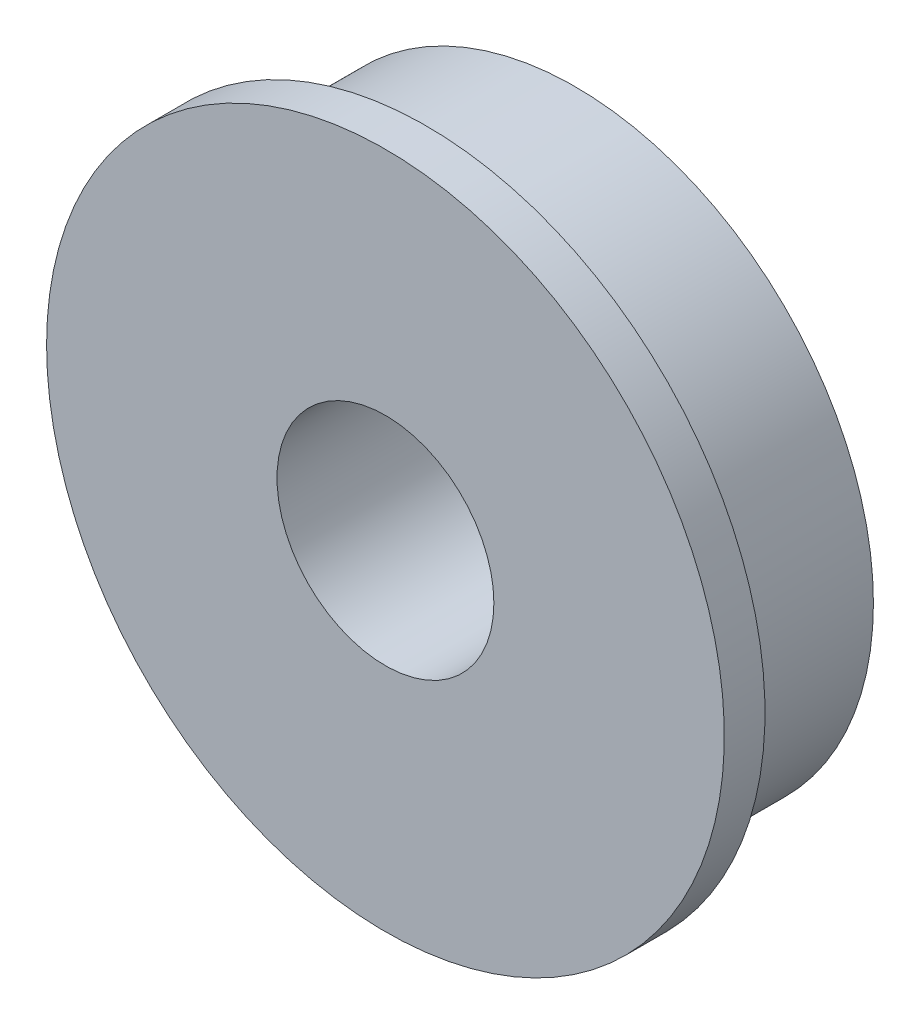
ISO-10303-21;
HEADER;
FILE_DESCRIPTION(('STEP AP214'),'2;1');
FILE_NAME('part.step','',(''),(''),'','','');
FILE_SCHEMA(('AUTOMOTIVE_DESIGN { 1 0 10303 214 1 1 1 1 }'));
ENDSEC;
DATA;
#1=APPLICATION_CONTEXT('core data for automotive mechanical design processes');
#2=APPLICATION_PROTOCOL_DEFINITION('international standard','automotive_design',2000,#1);
#3=PRODUCT_CONTEXT('',#1,'mechanical');
#4=PRODUCT('Part','Part','',(#3));
#5=PRODUCT_RELATED_PRODUCT_CATEGORY('part','',(#4));
#6=PRODUCT_DEFINITION_FORMATION('','',#4);
#7=PRODUCT_DEFINITION_CONTEXT('part definition',#1,'design');
#8=PRODUCT_DEFINITION('design','',#6,#7);
#9=PRODUCT_DEFINITION_SHAPE('','',#8);
#10=(LENGTH_UNIT() NAMED_UNIT(*) SI_UNIT(.MILLI.,.METRE.));
#11=(NAMED_UNIT(*) PLANE_ANGLE_UNIT() SI_UNIT($,.RADIAN.));
#12=(NAMED_UNIT(*) SI_UNIT($,.STERADIAN.) SOLID_ANGLE_UNIT());
#13=UNCERTAINTY_MEASURE_WITH_UNIT(LENGTH_MEASURE(1.E-05),#10,'distance_accuracy_value','');
#14=(GEOMETRIC_REPRESENTATION_CONTEXT(3) GLOBAL_UNCERTAINTY_ASSIGNED_CONTEXT((#13)) GLOBAL_UNIT_ASSIGNED_CONTEXT((#10,
#11,#12)) REPRESENTATION_CONTEXT('',''));
#15=CARTESIAN_POINT('',(0.,0.,0.));
#16=DIRECTION('',(0.,0.,1.));
#17=DIRECTION('',(1.,0.,0.));
#18=AXIS2_PLACEMENT_3D('',#15,#16,#17);
#19=CARTESIAN_POINT('',(0.,0.,0.));
#20=DIRECTION('',(0.,0.,1.));
#21=DIRECTION('',(1.,0.,0.));
#22=AXIS2_PLACEMENT_3D('',#19,#20,#21);
#23=CYLINDRICAL_SURFACE('',#22,11.);
#24=CARTESIAN_POINT('',(0.,0.,0.));
#25=DIRECTION('',(0.,0.,1.));
#26=DIRECTION('',(1.,0.,0.));
#27=AXIS2_PLACEMENT_3D('',#24,#25,#26);
#28=CIRCLE('',#27,11.);
#29=CARTESIAN_POINT('',(11.,0.,0.));
#30=VERTEX_POINT('',#29);
#31=EDGE_CURVE('E33',#30,#30,#28,.T.);
#32=ORIENTED_EDGE('',*,*,#31,.T.);
#33=EDGE_LOOP('',(#32));
#34=FACE_BOUND('',#33,.T.);
#35=CARTESIAN_POINT('',(0.,0.,5.5));
#36=DIRECTION('',(0.,0.,1.));
#37=DIRECTION('',(1.,0.,0.));
#38=AXIS2_PLACEMENT_3D('',#35,#36,#37);
#39=CIRCLE('',#38,11.);
#40=CARTESIAN_POINT('',(11.,0.,5.5));
#41=VERTEX_POINT('',#40);
#42=EDGE_CURVE('E17',#41,#41,#39,.F.);
#43=ORIENTED_EDGE('',*,*,#42,.T.);
#44=EDGE_LOOP('',(#43));
#45=FACE_BOUND('',#44,.T.);
#46=ADVANCED_FACE('F14',(#34,#45),#23,.T.);
#47=CARTESIAN_POINT('',(0.,0.,5.5));
#48=DIRECTION('',(0.,0.,1.));
#49=DIRECTION('',(1.,0.,0.));
#50=AXIS2_PLACEMENT_3D('',#47,#48,#49);
#51=PLANE('',#50);
#52=CARTESIAN_POINT('',(0.,0.,5.5));
#53=DIRECTION('',(0.,0.,-1.));
#54=DIRECTION('',(-1.,0.,0.));
#55=AXIS2_PLACEMENT_3D('',#52,#53,#54);
#56=CIRCLE('',#55,12.5);
#57=CARTESIAN_POINT('',(-12.5,0.,5.5));
#58=VERTEX_POINT('',#57);
#59=EDGE_CURVE('E31',#58,#58,#56,.F.);
#60=ORIENTED_EDGE('',*,*,#59,.F.);
#61=EDGE_LOOP('',(#60));
#62=FACE_BOUND('',#61,.T.);
#63=ORIENTED_EDGE('',*,*,#42,.F.);
#64=EDGE_LOOP('',(#63));
#65=FACE_BOUND('',#64,.T.);
#66=ADVANCED_FACE('F41',(#62,#65),#51,.F.);
#67=CARTESIAN_POINT('',(0.,0.,0.));
#68=DIRECTION('',(0.,0.,1.));
#69=DIRECTION('',(1.,0.,0.));
#70=AXIS2_PLACEMENT_3D('',#67,#68,#69);
#71=PLANE('',#70);
#72=ORIENTED_EDGE('',*,*,#31,.F.);
#73=EDGE_LOOP('',(#72));
#74=FACE_BOUND('',#73,.T.);
#75=CARTESIAN_POINT('',(0.,0.,0.));
#76=DIRECTION('',(0.,0.,1.));
#77=DIRECTION('',(1.,0.,0.));
#78=AXIS2_PLACEMENT_3D('',#75,#76,#77);
#79=CIRCLE('',#78,4.);
#80=CARTESIAN_POINT('',(4.,0.,0.));
#81=VERTEX_POINT('',#80);
#82=EDGE_CURVE('E26',#81,#81,#79,.T.);
#83=ORIENTED_EDGE('',*,*,#82,.T.);
#84=EDGE_LOOP('',(#83));
#85=FACE_BOUND('',#84,.T.);
#86=ADVANCED_FACE('F43',(#74,#85),#71,.F.);
#87=CARTESIAN_POINT('',(0.,0.,7.));
#88=DIRECTION('',(0.,0.,-1.));
#89=DIRECTION('',(-1.,0.,0.));
#90=AXIS2_PLACEMENT_3D('',#87,#88,#89);
#91=CYLINDRICAL_SURFACE('',#90,12.5);
#92=CARTESIAN_POINT('',(0.,0.,7.));
#93=DIRECTION('',(0.,0.,-1.));
#94=DIRECTION('',(-1.,0.,0.));
#95=AXIS2_PLACEMENT_3D('',#92,#93,#94);
#96=CIRCLE('',#95,12.5);
#97=CARTESIAN_POINT('',(-12.5,0.,7.));
#98=VERTEX_POINT('',#97);
#99=EDGE_CURVE('E21',#98,#98,#96,.F.);
#100=ORIENTED_EDGE('',*,*,#99,.F.);
#101=EDGE_LOOP('',(#100));
#102=FACE_BOUND('',#101,.T.);
#103=ORIENTED_EDGE('',*,*,#59,.T.);
#104=EDGE_LOOP('',(#103));
#105=FACE_BOUND('',#104,.T.);
#106=ADVANCED_FACE('F50',(#102,#105),#91,.T.);
#107=CARTESIAN_POINT('',(0.,0.,0.));
#108=DIRECTION('',(0.,0.,1.));
#109=DIRECTION('',(1.,0.,0.));
#110=AXIS2_PLACEMENT_3D('',#107,#108,#109);
#111=CYLINDRICAL_SURFACE('',#110,4.);
#112=ORIENTED_EDGE('',*,*,#82,.F.);
#113=EDGE_LOOP('',(#112));
#114=FACE_BOUND('',#113,.T.);
#115=CARTESIAN_POINT('',(0.,0.,7.));
#116=DIRECTION('',(0.,0.,1.));
#117=DIRECTION('',(1.,0.,0.));
#118=AXIS2_PLACEMENT_3D('',#115,#116,#117);
#119=CIRCLE('',#118,4.);
#120=CARTESIAN_POINT('',(4.,0.,7.));
#121=VERTEX_POINT('',#120);
#122=EDGE_CURVE('E10',#121,#121,#119,.F.);
#123=ORIENTED_EDGE('',*,*,#122,.F.);
#124=EDGE_LOOP('',(#123));
#125=FACE_BOUND('',#124,.T.);
#126=ADVANCED_FACE('F56',(#114,#125),#111,.F.);
#127=CARTESIAN_POINT('',(0.,0.,7.));
#128=DIRECTION('',(0.,0.,1.));
#129=DIRECTION('',(1.,0.,0.));
#130=AXIS2_PLACEMENT_3D('',#127,#128,#129);
#131=PLANE('',#130);
#132=ORIENTED_EDGE('',*,*,#122,.T.);
#133=EDGE_LOOP('',(#132));
#134=FACE_BOUND('',#133,.T.);
#135=ORIENTED_EDGE('',*,*,#99,.T.);
#136=EDGE_LOOP('',(#135));
#137=FACE_BOUND('',#136,.T.);
#138=ADVANCED_FACE('F54',(#134,#137),#131,.T.);
#139=CLOSED_SHELL('',(#46,#66,#86,#106,#126,#138));
#140=MANIFOLD_SOLID_BREP('B1',#139);
#141=ADVANCED_BREP_SHAPE_REPRESENTATION('',(#18,#140),#14);
#142=SHAPE_DEFINITION_REPRESENTATION(#9,#141);
ENDSEC;
END-ISO-10303-21;
